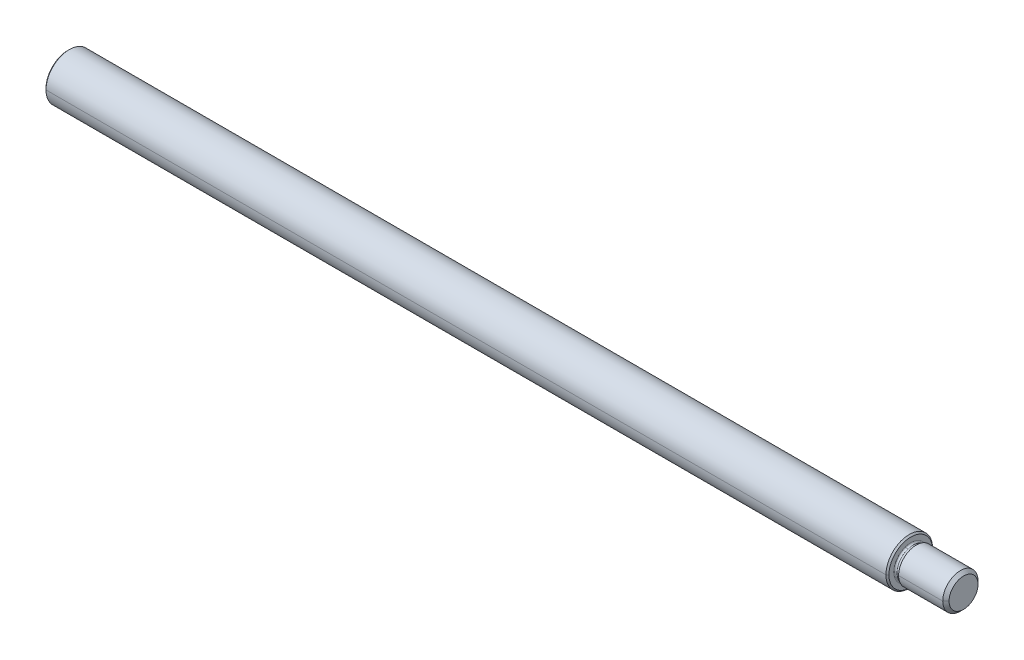
ISO-10303-21;
HEADER;
FILE_DESCRIPTION(('STEP AP214'),'2;1');
FILE_NAME('part.step','',(''),(''),'','','');
FILE_SCHEMA(('AUTOMOTIVE_DESIGN { 1 0 10303 214 1 1 1 1 }'));
ENDSEC;
DATA;
#1=APPLICATION_CONTEXT('core data for automotive mechanical design processes');
#2=APPLICATION_PROTOCOL_DEFINITION('international standard','automotive_design',2000,#1);
#3=PRODUCT_CONTEXT('',#1,'mechanical');
#4=PRODUCT('Part','Part','',(#3));
#5=PRODUCT_RELATED_PRODUCT_CATEGORY('part','',(#4));
#6=PRODUCT_DEFINITION_FORMATION('','',#4);
#7=PRODUCT_DEFINITION_CONTEXT('part definition',#1,'design');
#8=PRODUCT_DEFINITION('design','',#6,#7);
#9=PRODUCT_DEFINITION_SHAPE('','',#8);
#10=(LENGTH_UNIT() NAMED_UNIT(*) SI_UNIT(.MILLI.,.METRE.));
#11=(NAMED_UNIT(*) PLANE_ANGLE_UNIT() SI_UNIT($,.RADIAN.));
#12=(NAMED_UNIT(*) SI_UNIT($,.STERADIAN.) SOLID_ANGLE_UNIT());
#13=UNCERTAINTY_MEASURE_WITH_UNIT(LENGTH_MEASURE(1.E-05),#10,'distance_accuracy_value','');
#14=(GEOMETRIC_REPRESENTATION_CONTEXT(3) GLOBAL_UNCERTAINTY_ASSIGNED_CONTEXT((#13)) GLOBAL_UNIT_ASSIGNED_CONTEXT((#10,
#11,#12)) REPRESENTATION_CONTEXT('',''));
#15=CARTESIAN_POINT('',(0.,0.,0.));
#16=DIRECTION('',(0.,0.,1.));
#17=DIRECTION('',(1.,0.,0.));
#18=AXIS2_PLACEMENT_3D('',#15,#16,#17);
#19=CARTESIAN_POINT('',(-152.4,0.,0.));
#20=DIRECTION('',(1.,0.,0.));
#21=DIRECTION('',(0.,0.,-1.));
#22=AXIS2_PLACEMENT_3D('',#19,#20,#21);
#23=PLANE('',#22);
#24=CARTESIAN_POINT('',(-152.4,0.,0.));
#25=DIRECTION('',(1.,0.,0.));
#26=DIRECTION('',(0.,0.,-1.));
#27=AXIS2_PLACEMENT_3D('',#24,#25,#26);
#28=CIRCLE('',#27,7.4295);
#29=CARTESIAN_POINT('',(-152.4,0.,7.4295));
#30=VERTEX_POINT('',#29);
#31=CARTESIAN_POINT('',(-152.4,0.,-7.4295));
#32=VERTEX_POINT('',#31);
#33=EDGE_CURVE('E11',#30,#32,#28,.T.);
#34=ORIENTED_EDGE('',*,*,#33,.F.);
#35=CARTESIAN_POINT('',(-152.4,0.,0.));
#36=DIRECTION('',(1.,0.,0.));
#37=DIRECTION('',(0.,0.,-1.));
#38=AXIS2_PLACEMENT_3D('',#35,#36,#37);
#39=CIRCLE('',#38,7.4295);
#40=EDGE_CURVE('E25',#32,#30,#39,.T.);
#41=ORIENTED_EDGE('',*,*,#40,.F.);
#42=EDGE_LOOP('',(#34,#41));
#43=FACE_BOUND('',#42,.T.);
#44=ADVANCED_FACE('F17',(#43),#23,.F.);
#45=CARTESIAN_POINT('',(-152.4,0.,0.));
#46=DIRECTION('',(1.,0.,0.));
#47=DIRECTION('',(0.,-1.,0.));
#48=AXIS2_PLACEMENT_3D('',#45,#46,#47);
#49=CONICAL_SURFACE('',#48,7.4295,0.785398163397385);
#50=DIRECTION('',(0.707106781186591,0.,0.707106781186504));
#51=VECTOR('',#50,1.);
#52=CARTESIAN_POINT('',(-152.4,0.,7.4295));
#53=LINE('',#52,#51);
#54=CARTESIAN_POINT('',(-151.892,0.,7.93749999999997));
#55=VERTEX_POINT('',#54);
#56=EDGE_CURVE('E331',#30,#55,#53,.T.);
#57=ORIENTED_EDGE('',*,*,#56,.T.);
#58=CARTESIAN_POINT('',(-151.892,0.,0.));
#59=DIRECTION('',(1.,0.,0.));
#60=DIRECTION('',(0.,0.,-1.));
#61=AXIS2_PLACEMENT_3D('',#58,#59,#60);
#62=CIRCLE('',#61,7.9375);
#63=CARTESIAN_POINT('',(-151.892,0.,-7.9375));
#64=VERTEX_POINT('',#63);
#65=EDGE_CURVE('E326',#64,#55,#62,.T.);
#66=ORIENTED_EDGE('',*,*,#65,.F.);
#67=DIRECTION('',(0.707106781186591,0.,-0.707106781186504));
#68=VECTOR('',#67,1.);
#69=CARTESIAN_POINT('',(-152.4,0.,-7.4295));
#70=LINE('',#69,#68);
#71=EDGE_CURVE('E321',#32,#64,#70,.T.);
#72=ORIENTED_EDGE('',*,*,#71,.F.);
#73=ORIENTED_EDGE('',*,*,#40,.T.);
#74=EDGE_LOOP('',(#57,#66,#72,#73));
#75=FACE_BOUND('',#74,.T.);
#76=ADVANCED_FACE('F260',(#75),#49,.T.);
#77=CARTESIAN_POINT('',(-152.4,0.,0.));
#78=DIRECTION('',(1.,0.,0.));
#79=DIRECTION('',(0.,1.,0.));
#80=AXIS2_PLACEMENT_3D('',#77,#78,#79);
#81=CONICAL_SURFACE('',#80,7.4295,0.785398163397385);
#82=ORIENTED_EDGE('',*,*,#56,.F.);
#83=ORIENTED_EDGE('',*,*,#33,.T.);
#84=ORIENTED_EDGE('',*,*,#71,.T.);
#85=CARTESIAN_POINT('',(-151.892,0.,0.));
#86=DIRECTION('',(1.,0.,0.));
#87=DIRECTION('',(0.,0.,-1.));
#88=AXIS2_PLACEMENT_3D('',#85,#86,#87);
#89=CIRCLE('',#88,7.9375);
#90=EDGE_CURVE('E316',#55,#64,#89,.T.);
#91=ORIENTED_EDGE('',*,*,#90,.F.);
#92=EDGE_LOOP('',(#82,#83,#84,#91));
#93=FACE_BOUND('',#92,.T.);
#94=ADVANCED_FACE('F264',(#93),#81,.T.);
#95=CARTESIAN_POINT('',(134.4422,0.,0.));
#96=DIRECTION('',(1.,0.,0.));
#97=DIRECTION('',(0.,1.,0.));
#98=AXIS2_PLACEMENT_3D('',#95,#96,#97);
#99=CYLINDRICAL_SURFACE('',#98,7.9375);
#100=DIRECTION('',(1.,0.,0.));
#101=VECTOR('',#100,1.);
#102=CARTESIAN_POINT('',(-151.892,0.,7.9375));
#103=LINE('',#102,#101);
#104=CARTESIAN_POINT('',(133.9342,0.,7.9375));
#105=VERTEX_POINT('',#104);
#106=EDGE_CURVE('E311',#55,#105,#103,.T.);
#107=ORIENTED_EDGE('',*,*,#106,.F.);
#108=ORIENTED_EDGE('',*,*,#90,.T.);
#109=DIRECTION('',(1.,0.,0.));
#110=VECTOR('',#109,1.);
#111=CARTESIAN_POINT('',(-151.892,0.,-7.9375));
#112=LINE('',#111,#110);
#113=CARTESIAN_POINT('',(133.9342,0.,-7.9375));
#114=VERTEX_POINT('',#113);
#115=EDGE_CURVE('E307',#64,#114,#112,.T.);
#116=ORIENTED_EDGE('',*,*,#115,.T.);
#117=CARTESIAN_POINT('',(133.9342,0.,0.));
#118=DIRECTION('',(1.,0.,0.));
#119=DIRECTION('',(0.,0.,-1.));
#120=AXIS2_PLACEMENT_3D('',#117,#118,#119);
#121=CIRCLE('',#120,7.9375);
#122=EDGE_CURVE('E290',#105,#114,#121,.T.);
#123=ORIENTED_EDGE('',*,*,#122,.F.);
#124=EDGE_LOOP('',(#107,#108,#116,#123));
#125=FACE_BOUND('',#124,.T.);
#126=ADVANCED_FACE('F269',(#125),#99,.T.);
#127=CARTESIAN_POINT('',(133.9342,0.,0.));
#128=DIRECTION('',(-1.,0.,0.));
#129=DIRECTION('',(0.,1.,0.));
#130=AXIS2_PLACEMENT_3D('',#127,#128,#129);
#131=CONICAL_SURFACE('',#130,7.9375,0.785398163397412);
#132=DIRECTION('',(-0.707106781186583,0.,-0.707106781186512));
#133=VECTOR('',#132,1.);
#134=CARTESIAN_POINT('',(134.4422,0.,-7.42950000000001));
#135=LINE('',#134,#133);
#136=CARTESIAN_POINT('',(134.4422,0.,-7.4295));
#137=VERTEX_POINT('',#136);
#138=EDGE_CURVE('E284',#137,#114,#135,.T.);
#139=ORIENTED_EDGE('',*,*,#138,.F.);
#140=CARTESIAN_POINT('',(134.4422,0.,0.));
#141=DIRECTION('',(1.,0.,0.));
#142=DIRECTION('',(0.,0.,-1.));
#143=AXIS2_PLACEMENT_3D('',#140,#141,#142);
#144=CIRCLE('',#143,7.4295);
#145=CARTESIAN_POINT('',(134.4422,0.,7.42950000000001));
#146=VERTEX_POINT('',#145);
#147=EDGE_CURVE('E288',#146,#137,#144,.T.);
#148=ORIENTED_EDGE('',*,*,#147,.F.);
#149=DIRECTION('',(-0.707106781186583,0.,0.707106781186512));
#150=VECTOR('',#149,1.);
#151=CARTESIAN_POINT('',(134.4422,0.,7.42950000000001));
#152=LINE('',#151,#150);
#153=EDGE_CURVE('E294',#146,#105,#152,.T.);
#154=ORIENTED_EDGE('',*,*,#153,.T.);
#155=ORIENTED_EDGE('',*,*,#122,.T.);
#156=EDGE_LOOP('',(#139,#148,#154,#155));
#157=FACE_BOUND('',#156,.T.);
#158=ADVANCED_FACE('F274',(#157),#131,.T.);
#159=CARTESIAN_POINT('',(133.9342,0.,0.));
#160=DIRECTION('',(-1.,0.,0.));
#161=DIRECTION('',(0.,-1.,0.));
#162=AXIS2_PLACEMENT_3D('',#159,#160,#161);
#163=CONICAL_SURFACE('',#162,7.9375,0.785398163397412);
#164=ORIENTED_EDGE('',*,*,#138,.T.);
#165=CARTESIAN_POINT('',(133.9342,0.,0.));
#166=DIRECTION('',(1.,0.,0.));
#167=DIRECTION('',(0.,0.,-1.));
#168=AXIS2_PLACEMENT_3D('',#165,#166,#167);
#169=CIRCLE('',#168,7.9375);
#170=EDGE_CURVE('E295',#114,#105,#169,.T.);
#171=ORIENTED_EDGE('',*,*,#170,.T.);
#172=ORIENTED_EDGE('',*,*,#153,.F.);
#173=CARTESIAN_POINT('',(134.4422,0.,0.));
#174=DIRECTION('',(1.,0.,0.));
#175=DIRECTION('',(0.,0.,-1.));
#176=AXIS2_PLACEMENT_3D('',#173,#174,#175);
#177=CIRCLE('',#176,7.4295);
#178=EDGE_CURVE('E223',#137,#146,#177,.T.);
#179=ORIENTED_EDGE('',*,*,#178,.F.);
#180=EDGE_LOOP('',(#164,#171,#172,#179));
#181=FACE_BOUND('',#180,.T.);
#182=ADVANCED_FACE('F192',(#181),#163,.T.);
#183=CARTESIAN_POINT('',(134.4422,7.4295,0.));
#184=DIRECTION('',(-1.,0.,0.));
#185=DIRECTION('',(0.,0.,1.));
#186=AXIS2_PLACEMENT_3D('',#183,#184,#185);
#187=PLANE('',#186);
#188=CARTESIAN_POINT('',(134.4422,5.4760734669325,1.77928412742479));
#189=CARTESIAN_POINT('',(134.4422,5.4469618697612,1.86888687805206));
#190=CARTESIAN_POINT('',(134.4422,5.41564742644602,1.95777370177562));
#191=CARTESIAN_POINT('',(134.4422,5.34869649858891,2.13390448070103));
#192=CARTESIAN_POINT('',(134.4422,5.31306001404697,2.22114843590288));
#193=CARTESIAN_POINT('',(134.4422,5.23754865479731,2.39378246307057));
#194=CARTESIAN_POINT('',(134.4422,5.19767378008959,2.47917253503641));
#195=CARTESIAN_POINT('',(134.4422,5.11378229215661,2.647893307678));
#196=CARTESIAN_POINT('',(134.4422,5.06976567893136,2.73122400835375));
#197=CARTESIAN_POINT('',(134.4422,4.97769659586184,2.8956252274086));
#198=CARTESIAN_POINT('',(134.4422,4.92964412601757,2.97669574578771));
#199=CARTESIAN_POINT('',(134.4422,4.82961913464889,3.13638131035984));
#200=CARTESIAN_POINT('',(134.4422,4.77764661312448,3.21499635655287));
#201=CARTESIAN_POINT('',(134.4422,4.6699067134098,3.36958158190931));
#202=CARTESIAN_POINT('',(134.4422,4.61413933521953,3.44555176107274));
#203=CARTESIAN_POINT('',(134.4422,4.49894407371101,3.59466423470941));
#204=CARTESIAN_POINT('',(134.4422,4.43951619039275,3.66780652918265));
#205=CARTESIAN_POINT('',(134.4422,4.31714308479009,3.81108702693553));
#206=CARTESIAN_POINT('',(134.4422,4.25419786250569,3.88122523021516));
#207=CARTESIAN_POINT('',(134.4422,4.12494171974278,4.01832857658866));
#208=CARTESIAN_POINT('',(134.4422,4.05863079926427,4.08529371968253));
#209=CARTESIAN_POINT('',(134.4422,3.92280300887025,4.21588962076714));
#210=CARTESIAN_POINT('',(134.4422,3.85328613895474,4.27952037875786));
#211=CARTESIAN_POINT('',(134.4422,3.71121392193099,4.40329421757273));
#212=CARTESIAN_POINT('',(134.4422,3.63865857482274,4.46343729839687));
#213=CARTESIAN_POINT('',(134.4422,3.49068419559558,4.58009089292735));
#214=CARTESIAN_POINT('',(134.4422,3.41526516347667,4.63660140663369));
#215=CARTESIAN_POINT('',(134.4422,3.26174510528362,4.74585372815174));
#216=CARTESIAN_POINT('',(134.4422,3.18364407920948,4.79859553596345));
#217=CARTESIAN_POINT('',(134.4422,3.02494818531831,4.90018338605748));
#218=CARTESIAN_POINT('',(134.4422,2.94435331750129,4.94902942833979));
#219=CARTESIAN_POINT('',(134.4422,2.7808639002203,5.04270807298079));
#220=CARTESIAN_POINT('',(134.4422,2.69796935075633,5.08754067533947));
#221=CARTESIAN_POINT('',(134.4422,2.53008027041177,5.17308443446724));
#222=CARTESIAN_POINT('',(134.4422,2.44508573953119,5.21379559123632));
#223=CARTESIAN_POINT('',(134.4422,2.27320145562296,5.29099838244237));
#224=CARTESIAN_POINT('',(134.4422,2.1863117025953,5.32749001687933));
#225=CARTESIAN_POINT('',(134.4422,2.01084629941861,5.39616585187748));
#226=CARTESIAN_POINT('',(134.4422,1.92227064926958,5.42835005243866));
#227=CARTESIAN_POINT('',(134.4422,1.74364683834964,5.4883334851271));
#228=CARTESIAN_POINT('',(134.4422,1.65359867757874,5.51613271725436));
#229=CARTESIAN_POINT('',(134.4422,1.47224677932166,5.56727924228982));
#230=CARTESIAN_POINT('',(134.4422,1.38094304183547,5.59062653519803));
#231=CARTESIAN_POINT('',(134.4422,1.1972999488487,5.63281293612179));
#232=CARTESIAN_POINT('',(134.4422,1.1049605933481,5.65165204413735));
#233=CARTESIAN_POINT('',(134.4422,0.919468717927874,5.68477669021451));
#234=CARTESIAN_POINT('',(134.4422,0.826316198008239,5.6990622282761));
#235=CARTESIAN_POINT('',(134.4422,0.639422406329614,5.72304531933286));
#236=CARTESIAN_POINT('',(134.4422,0.545681134570623,5.73274287232803));
#237=CARTESIAN_POINT('',(134.4422,0.357835670147717,5.74752663099738));
#238=CARTESIAN_POINT('',(134.4422,0.263731477483802,5.75261283667155));
#239=CARTESIAN_POINT('',(134.4422,0.0753868764937317,5.75816164758394));
#240=CARTESIAN_POINT('',(134.4422,-0.0188535318324239,5.75862425282216));
#241=CARTESIAN_POINT('',(134.4422,-0.207243530748836,5.75492474840609));
#242=CARTESIAN_POINT('',(134.4422,-0.301393121339093,5.7507626387518));
#243=CARTESIAN_POINT('',(134.4422,-0.489374670173443,5.73782373143745));
#244=CARTESIAN_POINT('',(134.4422,-0.583206628417536,5.72904693377738));
#245=CARTESIAN_POINT('',(134.4422,-0.770326863153443,5.70689979452577));
#246=CARTESIAN_POINT('',(134.4422,-0.863615139645256,5.69352945293424));
#247=CARTESIAN_POINT('',(134.4422,-1.04942327124744,5.6622274361437));
#248=CARTESIAN_POINT('',(134.4422,-1.14194312635782,5.6442957609447));
#249=CARTESIAN_POINT('',(134.4422,-1.32599152676238,5.6039142759154));
#250=CARTESIAN_POINT('',(134.4422,-1.41752007205657,5.58146446608512));
#251=CARTESIAN_POINT('',(134.4422,-1.59936535254621,5.53210079535151));
#252=CARTESIAN_POINT('',(134.4422,-1.68968208774165,5.50518693444819));
#253=CARTESIAN_POINT('',(134.4422,-1.8688861671079,5.44695999941682));
#254=CARTESIAN_POINT('',(134.4422,-1.9577735112787,5.41564692528876));
#255=CARTESIAN_POINT('',(134.4422,-2.13390467119793,5.34869699974618));
#256=CARTESIAN_POINT('',(134.4422,-2.22114848694636,5.31306014833166));
#257=CARTESIAN_POINT('',(134.4422,-2.39378241202706,5.23754852051263));
#258=CARTESIAN_POINT('',(134.4422,-2.47917252135933,5.19767374410812));
#259=CARTESIAN_POINT('',(134.4422,-2.64789332135505,5.11378232813809));
#260=CARTESIAN_POINT('',(134.4422,-2.73122401201849,5.06976568857257));
#261=CARTESIAN_POINT('',(134.4422,-2.89562522374383,4.97769658622064));
#262=CARTESIAN_POINT('',(134.4422,-2.97669574480573,4.92964412343422));
#263=CARTESIAN_POINT('',(134.4422,-3.1363813113418,4.82961913723225));
#264=CARTESIAN_POINT('',(134.4422,-3.21499635681598,4.77764661381669));
#265=CARTESIAN_POINT('',(134.4422,-3.36958158164619,4.6699067127176));
#266=CARTESIAN_POINT('',(134.4422,-3.44555176100223,4.61413933503406));
#267=CARTESIAN_POINT('',(134.4422,-3.5946642347799,4.49894407389649));
#268=CARTESIAN_POINT('',(134.4422,-3.66780652920154,4.43951619044245));
#269=CARTESIAN_POINT('',(134.4422,-3.81108702691663,4.3171430847404));
#270=CARTESIAN_POINT('',(134.4422,-3.88122523021009,4.25419786249238));
#271=CARTESIAN_POINT('',(134.4422,-4.01832857659371,4.12494171975611));
#272=CARTESIAN_POINT('',(134.4422,-4.08529371968388,4.05863079926784));
#273=CARTESIAN_POINT('',(134.4422,-4.21588962076577,3.92280300886669));
#274=CARTESIAN_POINT('',(134.4422,-4.27952037875749,3.85328613895379));
#275=CARTESIAN_POINT('',(134.4422,-4.40329421757309,3.71121392193195));
#276=CARTESIAN_POINT('',(134.4422,-4.46343729839696,3.638658574823));
#277=CARTESIAN_POINT('',(134.4422,-4.58009089292725,3.49068419559533));
#278=CARTESIAN_POINT('',(134.4422,-4.63660140663366,3.41526516347661));
#279=CARTESIAN_POINT('',(134.4422,-4.74585372815176,3.2617451052837));
#280=CARTESIAN_POINT('',(134.4422,-4.79859553596345,3.1836440792095));
#281=CARTESIAN_POINT('',(134.4422,-4.90018338605746,3.02494818531831));
#282=CARTESIAN_POINT('',(134.4422,-4.94902942833978,2.9443533175013));
#283=CARTESIAN_POINT('',(134.4422,-5.04270807298078,2.78086390022031));
#284=CARTESIAN_POINT('',(134.4422,-5.08754067533947,2.69796935075634));
#285=CARTESIAN_POINT('',(134.4422,-5.17308443446723,2.53008027041178));
#286=CARTESIAN_POINT('',(134.4422,-5.21379559123632,2.4450857395312));
#287=CARTESIAN_POINT('',(134.4422,-5.29099838244237,2.27320145562296));
#288=CARTESIAN_POINT('',(134.4422,-5.32749001687935,2.18631170259531));
#289=CARTESIAN_POINT('',(134.4422,-5.39616585187745,2.01084629941863));
#290=CARTESIAN_POINT('',(134.4422,-5.42835005243859,1.92227064926961));
#291=CARTESIAN_POINT('',(134.4422,-5.48833348512717,1.74364683834963));
#292=CARTESIAN_POINT('',(134.4422,-5.51613271725462,1.65359867757868));
#293=CARTESIAN_POINT('',(134.4422,-5.56727924228955,1.47224677932174));
#294=CARTESIAN_POINT('',(134.4422,-5.59062653519704,1.38094304183576));
#295=CARTESIAN_POINT('',(134.4422,-5.63281293612278,1.19729994884844));
#296=CARTESIAN_POINT('',(134.4422,-5.65165204414103,1.10496059334711));
#297=CARTESIAN_POINT('',(134.4422,-5.68477669021082,0.919468717928886));
#298=CARTESIAN_POINT('',(134.4422,-5.69906222826235,0.826316198011985));
#299=CARTESIAN_POINT('',(134.4422,-5.72304531934661,0.639422406325896));
#300=CARTESIAN_POINT('',(134.4422,-5.73274287237934,0.545681134556707));
#301=CARTESIAN_POINT('',(134.4422,-5.74752663094606,0.357835670161657));
#302=CARTESIAN_POINT('',(134.4422,-5.75261283648006,0.263731477535797));
#303=CARTESIAN_POINT('',(134.4422,-5.75816164777544,0.075386876441761));
#304=CARTESIAN_POINT('',(134.4422,-5.75862425353682,-0.0188535320264151));
#305=CARTESIAN_POINT('',(134.4422,-5.75492474769142,-0.207243530554822));
#306=CARTESIAN_POINT('',(134.4422,-5.75076263608464,-0.301393120615053));
#307=CARTESIAN_POINT('',(134.4422,-5.73782373410461,-0.489374670897458));
#308=CARTESIAN_POINT('',(134.4422,-5.72904694373137,-0.583206631119631));
#309=CARTESIAN_POINT('',(134.4422,-5.70689978457178,-0.770326860451321));
#310=CARTESIAN_POINT('',(134.4422,-5.69352941578544,-0.863615129560838));
#311=CARTESIAN_POINT('',(134.4422,-5.6622274732925,-1.04942328133183));
#312=CARTESIAN_POINT('',(134.4422,-5.6442958995859,-1.1419431639933));
#313=CARTESIAN_POINT('',(134.4422,-5.6039141372742,-1.32599148912686));
#314=CARTESIAN_POINT('',(134.4422,-5.5814639486691,-1.41751993159895));
#315=CARTESIAN_POINT('',(134.4422,-5.53210131276754,-1.59936549300381));
#316=CARTESIAN_POINT('',(134.4422,-5.50518886547108,-1.68968261193659));
#317=CARTESIAN_POINT('',(134.4422,-5.47607346693251,-1.77928412742477));
#318=B_SPLINE_CURVE_WITH_KNOTS('',3,(#188,#189,#190,#191,#192,#193,#194,#195,#196,#197,#198,
#199,#200,#201,#202,#203,#204,#205,#206,#207,#208,#209,#210,#211,#212,#213,#214,#215,#216,#217,
#218,#219,#220,#221,#222,#223,#224,#225,#226,#227,#228,#229,#230,#231,#232,#233,#234,#235,#236,
#237,#238,#239,#240,#241,#242,#243,#244,#245,#246,#247,#248,#249,#250,#251,#252,#253,#254,#255,
#256,#257,#258,#259,#260,#261,#262,#263,#264,#265,#266,#267,#268,#269,#270,#271,#272,#273,#274,
#275,#276,#277,#278,#279,#280,#281,#282,#283,#284,#285,#286,#287,#288,#289,#290,#291,#292,#293,
#294,#295,#296,#297,#298,#299,#300,#301,#302,#303,#304,#305,#306,#307,#308,#309,#310,#311,#312,
#313,#314,#315,#316,#317),.UNSPECIFIED.,.F.,.F.,(4,2,2,2,2,2,2,2,2,2,2,2,2,2,2,2,2,2,2,2,2,2,2,
2,2,2,2,2,2,2,2,2,2,2,2,2,2,2,2,2,2,2,2,2,2,2,2,2,2,2,2,2,2,2,2,2,2,2,2,2,2,2,2,2,4),(0.,
0.282611113130821,0.565222226261641,0.847833339392463,1.13044445252328,1.4130555656541,
1.69566667878493,1.97827779191574,2.26088890504657,2.54350001817739,2.82611113130821,
3.10872224443903,3.39133335756985,3.67394447070067,3.95655558383149,4.23916669696231,
4.52177781009313,4.80438892322395,5.08700003635477,5.3696111494856,5.65222226261641,
5.93483337574724,6.21744448887806,6.50005560200888,6.7826667151397,7.06527782827052,
7.34788894140134,7.63050005453216,7.91311116766298,8.1957222807938,8.47833339392462,
8.76094450705544,9.04355562018626,9.32616673331708,9.6087778464479,9.89138895957872,
10.1740000727095,10.4566111858404,10.7392222989712,11.021833412102,11.3044445252328,
11.5870556383636,11.8696667514945,12.1522778646253,12.4348889777561,12.7175000908869,
13.0001112040178,13.2827223171486,13.5653334302794,13.8479445434102,14.130555656541,
14.4131667696719,14.6957778828027,14.9783889959335,15.2610001090643,15.5436112221951,
15.826222335326,16.1088334484568,16.3914445615876,16.6740556747184,16.9566667878492,
17.2392779009801,17.5218890141109,17.8045001272417,18.0871112403725),.UNSPECIFIED.);
#319=CARTESIAN_POINT('',(134.4422,5.4760734669325,1.77928412742479));
#320=VERTEX_POINT('',#319);
#321=CARTESIAN_POINT('',(134.4422,-5.4760734669325,-1.77928412742479));
#322=VERTEX_POINT('',#321);
#323=EDGE_CURVE('E215',#320,#322,#318,.T.);
#324=ORIENTED_EDGE('',*,*,#323,.F.);
#325=CARTESIAN_POINT('',(134.4422,-5.4760734669325,-1.77928412742479));
#326=CARTESIAN_POINT('',(134.4422,-5.4469618697612,-1.86888687805205));
#327=CARTESIAN_POINT('',(134.4422,-5.41564742644602,-1.95777370177562));
#328=CARTESIAN_POINT('',(134.4422,-5.34869649858891,-2.13390448070103));
#329=CARTESIAN_POINT('',(134.4422,-5.31306001404697,-2.22114843590287));
#330=CARTESIAN_POINT('',(134.4422,-5.23754865479731,-2.39378246307056));
#331=CARTESIAN_POINT('',(134.4422,-5.19767378008959,-2.47917253503641));
#332=CARTESIAN_POINT('',(134.4422,-5.11378229215661,-2.647893307678));
#333=CARTESIAN_POINT('',(134.4422,-5.06976567893136,-2.73122400835374));
#334=CARTESIAN_POINT('',(134.4422,-4.97769659586184,-2.8956252274086));
#335=CARTESIAN_POINT('',(134.4422,-4.92964412601757,-2.97669574578771));
#336=CARTESIAN_POINT('',(134.4422,-4.82961913464889,-3.13638131035984));
#337=CARTESIAN_POINT('',(134.4422,-4.77764661312448,-3.21499635655286));
#338=CARTESIAN_POINT('',(134.4422,-4.6699067134098,-3.36958158190931));
#339=CARTESIAN_POINT('',(134.4422,-4.61413933521953,-3.44555176107274));
#340=CARTESIAN_POINT('',(134.4422,-4.49894407371101,-3.59466423470941));
#341=CARTESIAN_POINT('',(134.4422,-4.43951619039275,-3.66780652918265));
#342=CARTESIAN_POINT('',(134.4422,-4.3171430847901,-3.81108702693553));
#343=CARTESIAN_POINT('',(134.4422,-4.25419786250569,-3.88122523021516));
#344=CARTESIAN_POINT('',(134.4422,-4.12494171974278,-4.01832857658866));
#345=CARTESIAN_POINT('',(134.4422,-4.05863079926427,-4.08529371968253));
#346=CARTESIAN_POINT('',(134.4422,-3.92280300887025,-4.21588962076713));
#347=CARTESIAN_POINT('',(134.4422,-3.85328613895474,-4.27952037875786));
#348=CARTESIAN_POINT('',(134.4422,-3.71121392193099,-4.40329421757273));
#349=CARTESIAN_POINT('',(134.4422,-3.63865857482274,-4.46343729839687));
#350=CARTESIAN_POINT('',(134.4422,-3.49068419559558,-4.58009089292735));
#351=CARTESIAN_POINT('',(134.4422,-3.41526516347667,-4.63660140663369));
#352=CARTESIAN_POINT('',(134.4422,-3.26174510528362,-4.74585372815174));
#353=CARTESIAN_POINT('',(134.4422,-3.18364407920948,-4.79859553596345));
#354=CARTESIAN_POINT('',(134.4422,-3.02494818531832,-4.90018338605747));
#355=CARTESIAN_POINT('',(134.4422,-2.9443533175013,-4.94902942833979));
#356=CARTESIAN_POINT('',(134.4422,-2.7808639002203,-5.04270807298079));
#357=CARTESIAN_POINT('',(134.4422,-2.69796935075633,-5.08754067533947));
#358=CARTESIAN_POINT('',(134.4422,-2.53008027041177,-5.17308443446724));
#359=CARTESIAN_POINT('',(134.4422,-2.44508573953119,-5.21379559123632));
#360=CARTESIAN_POINT('',(134.4422,-2.27320145562296,-5.29099838244237));
#361=CARTESIAN_POINT('',(134.4422,-2.18631170259531,-5.32749001687933));
#362=CARTESIAN_POINT('',(134.4422,-2.01084629941862,-5.39616585187748));
#363=CARTESIAN_POINT('',(134.4422,-1.92227064926958,-5.42835005243866));
#364=CARTESIAN_POINT('',(134.4422,-1.74364683834964,-5.4883334851271));
#365=CARTESIAN_POINT('',(134.4422,-1.65359867757874,-5.51613271725436));
#366=CARTESIAN_POINT('',(134.4422,-1.47224677932166,-5.56727924228982));
#367=CARTESIAN_POINT('',(134.4422,-1.38094304183548,-5.59062653519803));
#368=CARTESIAN_POINT('',(134.4422,-1.1972999488487,-5.63281293612179));
#369=CARTESIAN_POINT('',(134.4422,-1.10496059334811,-5.65165204413735));
#370=CARTESIAN_POINT('',(134.4422,-0.919468717927879,-5.6847766902145));
#371=CARTESIAN_POINT('',(134.4422,-0.826316198008245,-5.6990622282761));
#372=CARTESIAN_POINT('',(134.4422,-0.63942240632962,-5.72304531933286));
#373=CARTESIAN_POINT('',(134.4422,-0.545681134570629,-5.73274287232803));
#374=CARTESIAN_POINT('',(134.4422,-0.357835670147723,-5.74752663099738));
#375=CARTESIAN_POINT('',(134.4422,-0.263731477483808,-5.75261283667155));
#376=CARTESIAN_POINT('',(134.4422,-0.0753868764937364,-5.75816164758394));
#377=CARTESIAN_POINT('',(134.4422,0.01885353183242,-5.75862425282216));
#378=CARTESIAN_POINT('',(134.4422,0.207243530748832,-5.75492474840609));
#379=CARTESIAN_POINT('',(134.4422,0.301393121339088,-5.7507626387518));
#380=CARTESIAN_POINT('',(134.4422,0.489374670173438,-5.73782373143745));
#381=CARTESIAN_POINT('',(134.4422,0.583206628417531,-5.72904693377738));
#382=CARTESIAN_POINT('',(134.4422,0.770326863153435,-5.70689979452577));
#383=CARTESIAN_POINT('',(134.4422,0.863615139645247,-5.69352945293424));
#384=CARTESIAN_POINT('',(134.4422,1.04942327124743,-5.6622274361437));
#385=CARTESIAN_POINT('',(134.4422,1.14194312635781,-5.6442957609447));
#386=CARTESIAN_POINT('',(134.4422,1.32599152676238,-5.60391427591541));
#387=CARTESIAN_POINT('',(134.4422,1.41752007205657,-5.58146446608512));
#388=CARTESIAN_POINT('',(134.4422,1.59936535254621,-5.53210079535152));
#389=CARTESIAN_POINT('',(134.4422,1.68968208774165,-5.5051869344482));
#390=CARTESIAN_POINT('',(134.4422,1.86888616710789,-5.44695999941682));
#391=CARTESIAN_POINT('',(134.4422,1.95777351127869,-5.41564692528876));
#392=CARTESIAN_POINT('',(134.4422,2.13390467119792,-5.34869699974618));
#393=CARTESIAN_POINT('',(134.4422,2.22114848694635,-5.31306014833166));
#394=CARTESIAN_POINT('',(134.4422,2.39378241202706,-5.23754852051263));
#395=CARTESIAN_POINT('',(134.4422,2.47917252135933,-5.19767374410812));
#396=CARTESIAN_POINT('',(134.4422,2.64789332135505,-5.11378232813809));
#397=CARTESIAN_POINT('',(134.4422,2.73122401201849,-5.06976568857257));
#398=CARTESIAN_POINT('',(134.4422,2.89562522374383,-4.97769658622064));
#399=CARTESIAN_POINT('',(134.4422,2.97669574480572,-4.92964412343423));
#400=CARTESIAN_POINT('',(134.4422,3.1363813113418,-4.82961913723225));
#401=CARTESIAN_POINT('',(134.4422,3.21499635681597,-4.7776466138167));
#402=CARTESIAN_POINT('',(134.4422,3.36958158164618,-4.6699067127176));
#403=CARTESIAN_POINT('',(134.4422,3.44555176100222,-4.61413933503406));
#404=CARTESIAN_POINT('',(134.4422,3.5946642347799,-4.49894407389649));
#405=CARTESIAN_POINT('',(134.4422,3.66780652920153,-4.43951619044246));
#406=CARTESIAN_POINT('',(134.4422,3.81108702691662,-4.31714308474041));
#407=CARTESIAN_POINT('',(134.4422,3.88122523021008,-4.25419786249239));
#408=CARTESIAN_POINT('',(134.4422,4.01832857659371,-4.12494171975611));
#409=CARTESIAN_POINT('',(134.4422,4.08529371968388,-4.05863079926785));
#410=CARTESIAN_POINT('',(134.4422,4.21588962076577,-3.92280300886669));
#411=CARTESIAN_POINT('',(134.4422,4.27952037875749,-3.8532861389538));
#412=CARTESIAN_POINT('',(134.4422,4.40329421757308,-3.71121392193196));
#413=CARTESIAN_POINT('',(134.4422,4.46343729839695,-3.63865857482301));
#414=CARTESIAN_POINT('',(134.4422,4.58009089292724,-3.49068419559534));
#415=CARTESIAN_POINT('',(134.4422,4.63660140663365,-3.41526516347662));
#416=CARTESIAN_POINT('',(134.4422,4.74585372815175,-3.2617451052837));
#417=CARTESIAN_POINT('',(134.4422,4.79859553596345,-3.18364407920951));
#418=CARTESIAN_POINT('',(134.4422,4.90018338605746,-3.02494818531831));
#419=CARTESIAN_POINT('',(134.4422,4.94902942833978,-2.94435331750131));
#420=CARTESIAN_POINT('',(134.4422,5.04270807298078,-2.78086390022032));
#421=CARTESIAN_POINT('',(134.4422,5.08754067533946,-2.69796935075634));
#422=CARTESIAN_POINT('',(134.4422,5.17308443446723,-2.53008027041179));
#423=CARTESIAN_POINT('',(134.4422,5.21379559123631,-2.44508573953121));
#424=CARTESIAN_POINT('',(134.4422,5.29099838244237,-2.27320145562297));
#425=CARTESIAN_POINT('',(134.4422,5.32749001687934,-2.18631170259532));
#426=CARTESIAN_POINT('',(134.4422,5.39616585187745,-2.01084629941864));
#427=CARTESIAN_POINT('',(134.4422,5.42835005243858,-1.92227064926962));
#428=CARTESIAN_POINT('',(134.4422,5.48833348512717,-1.74364683834964));
#429=CARTESIAN_POINT('',(134.4422,5.51613271725462,-1.65359867757869));
#430=CARTESIAN_POINT('',(134.4422,5.56727924228955,-1.47224677932175));
#431=CARTESIAN_POINT('',(134.4422,5.59062653519704,-1.38094304183576));
#432=CARTESIAN_POINT('',(134.4422,5.63281293612278,-1.19729994884845));
#433=CARTESIAN_POINT('',(134.4422,5.65165204414103,-1.10496059334712));
#434=CARTESIAN_POINT('',(134.4422,5.68477669021082,-0.919468717928895));
#435=CARTESIAN_POINT('',(134.4422,5.69906222826235,-0.826316198011993));
#436=CARTESIAN_POINT('',(134.4422,5.72304531934661,-0.639422406325903));
#437=CARTESIAN_POINT('',(134.4422,5.73274287237934,-0.545681134556716));
#438=CARTESIAN_POINT('',(134.4422,5.74752663094606,-0.357835670161668));
#439=CARTESIAN_POINT('',(134.4422,5.75261283648006,-0.263731477535808));
#440=CARTESIAN_POINT('',(134.4422,5.75816164777544,-0.0753868764417721));
#441=CARTESIAN_POINT('',(134.4422,5.75862425353682,0.018853532026404));
#442=CARTESIAN_POINT('',(134.4422,5.75492474769142,0.207243530554811));
#443=CARTESIAN_POINT('',(134.4422,5.75076263608464,0.301393120615042));
#444=CARTESIAN_POINT('',(134.4422,5.73782373410461,0.489374670897447));
#445=CARTESIAN_POINT('',(134.4422,5.72904694373137,0.58320663111962));
#446=CARTESIAN_POINT('',(134.4422,5.70689978457178,0.770326860451312));
#447=CARTESIAN_POINT('',(134.4422,5.69352941578544,0.86361512956083));
#448=CARTESIAN_POINT('',(134.4422,5.6622274732925,1.04942328133182));
#449=CARTESIAN_POINT('',(134.4422,5.6442958995859,1.1419431639933));
#450=CARTESIAN_POINT('',(134.4422,5.6039141372742,1.32599148912686));
#451=CARTESIAN_POINT('',(134.4422,5.5814639486691,1.41751993159894));
#452=CARTESIAN_POINT('',(134.4422,5.53210131276754,1.5993654930038));
#453=CARTESIAN_POINT('',(134.4422,5.50518886547108,1.68968261193658));
#454=CARTESIAN_POINT('',(134.4422,5.47607346693251,1.77928412742476));
#455=B_SPLINE_CURVE_WITH_KNOTS('',3,(#325,#326,#327,#328,#329,#330,#331,#332,#333,#334,#335,
#336,#337,#338,#339,#340,#341,#342,#343,#344,#345,#346,#347,#348,#349,#350,#351,#352,#353,#354,
#355,#356,#357,#358,#359,#360,#361,#362,#363,#364,#365,#366,#367,#368,#369,#370,#371,#372,#373,
#374,#375,#376,#377,#378,#379,#380,#381,#382,#383,#384,#385,#386,#387,#388,#389,#390,#391,#392,
#393,#394,#395,#396,#397,#398,#399,#400,#401,#402,#403,#404,#405,#406,#407,#408,#409,#410,#411,
#412,#413,#414,#415,#416,#417,#418,#419,#420,#421,#422,#423,#424,#425,#426,#427,#428,#429,#430,
#431,#432,#433,#434,#435,#436,#437,#438,#439,#440,#441,#442,#443,#444,#445,#446,#447,#448,#449,
#450,#451,#452,#453,#454),.UNSPECIFIED.,.F.,.F.,(4,2,2,2,2,2,2,2,2,2,2,2,2,2,2,2,2,2,2,2,2,2,2,
2,2,2,2,2,2,2,2,2,2,2,2,2,2,2,2,2,2,2,2,2,2,2,2,2,2,2,2,2,2,2,2,2,2,2,2,2,2,2,2,2,4),(0.,
0.282611113130821,0.56522222626164,0.847833339392462,1.13044445252328,1.4130555656541,
1.69566667878492,1.97827779191574,2.26088890504656,2.54350001817739,2.82611113130821,
3.10872224443903,3.39133335756985,3.67394447070067,3.95655558383149,4.23916669696231,
4.52177781009313,4.80438892322395,5.08700003635477,5.36961114948559,5.65222226261641,
5.93483337574723,6.21744448887805,6.50005560200887,6.78266671513969,7.06527782827052,
7.34788894140134,7.63050005453216,7.91311116766298,8.19572228079379,8.47833339392462,
8.76094450705544,9.04355562018626,9.32616673331708,9.6087778464479,9.89138895957872,
10.1740000727095,10.4566111858404,10.7392222989712,11.021833412102,11.3044445252328,
11.5870556383636,11.8696667514945,12.1522778646253,12.4348889777561,12.7175000908869,
13.0001112040177,13.2827223171486,13.5653334302794,13.8479445434102,14.130555656541,
14.4131667696719,14.6957778828027,14.9783889959335,15.2610001090643,15.5436112221951,
15.826222335326,16.1088334484568,16.3914445615876,16.6740556747184,16.9566667878492,
17.2392779009801,17.5218890141109,17.8045001272417,18.0871112403725),.UNSPECIFIED.);
#456=EDGE_CURVE('E211',#322,#320,#455,.T.);
#457=ORIENTED_EDGE('',*,*,#456,.F.);
#458=EDGE_LOOP('',(#324,#457));
#459=FACE_BOUND('',#458,.T.);
#460=ORIENTED_EDGE('',*,*,#178,.T.);
#461=ORIENTED_EDGE('',*,*,#147,.T.);
#462=EDGE_LOOP('',(#460,#461));
#463=FACE_BOUND('',#462,.T.);
#464=ADVANCED_FACE('F186',(#459,#463),#187,.F.);
#465=CARTESIAN_POINT('',(134.9222,0.,0.));
#466=DIRECTION('',(1.,0.,0.));
#467=DIRECTION('',(0.,-0.309016994374947,0.951056516295154));
#468=AXIS2_PLACEMENT_3D('',#465,#466,#467);
#469=TOROIDAL_SURFACE('',#468,5.75788438763301,0.47999999999998);
#470=CARTESIAN_POINT('',(134.9222,-5.4760734669325,-1.77928412742479));
#471=DIRECTION('',(0.,0.309016994374947,-0.951056516295154));
#472=DIRECTION('',(-1.,0.,0.));
#473=AXIS2_PLACEMENT_3D('',#470,#471,#472);
#474=CIRCLE('',#473,0.47999999999999);
#475=CARTESIAN_POINT('',(135.1622,-5.08072669723029,-1.65082817510648));
#476=VERTEX_POINT('',#475);
#477=EDGE_CURVE('E166',#322,#476,#474,.T.);
#478=ORIENTED_EDGE('',*,*,#477,.F.);
#479=ORIENTED_EDGE('',*,*,#456,.T.);
#480=CARTESIAN_POINT('',(134.9222,5.4760734669325,1.77928412742479));
#481=DIRECTION('',(0.,-0.309016994374947,0.951056516295154));
#482=DIRECTION('',(-1.,0.,0.));
#483=AXIS2_PLACEMENT_3D('',#480,#481,#482);
#484=CIRCLE('',#483,0.47999999999999);
#485=CARTESIAN_POINT('',(135.1622,5.08072669723029,1.65082817510648));
#486=VERTEX_POINT('',#485);
#487=EDGE_CURVE('E162',#320,#486,#484,.T.);
#488=ORIENTED_EDGE('',*,*,#487,.T.);
#489=CARTESIAN_POINT('',(135.1622,0.,0.));
#490=DIRECTION('',(1.,0.,0.));
#491=DIRECTION('',(0.,0.,-1.));
#492=AXIS2_PLACEMENT_3D('',#489,#490,#491);
#493=CIRCLE('',#492,5.34219219381651);
#494=CARTESIAN_POINT('',(135.1622,0.,-5.34219219381651));
#495=VERTEX_POINT('',#494);
#496=EDGE_CURVE('E157',#495,#486,#493,.T.);
#497=ORIENTED_EDGE('',*,*,#496,.F.);
#498=CARTESIAN_POINT('',(135.1622,0.,0.));
#499=DIRECTION('',(1.,0.,0.));
#500=DIRECTION('',(0.,0.,-1.));
#501=AXIS2_PLACEMENT_3D('',#498,#499,#500);
#502=CIRCLE('',#501,5.34219219381651);
#503=EDGE_CURVE('E152',#476,#495,#502,.T.);
#504=ORIENTED_EDGE('',*,*,#503,.F.);
#505=EDGE_LOOP('',(#478,#479,#488,#497,#504));
#506=FACE_BOUND('',#505,.T.);
#507=ADVANCED_FACE('F175',(#506),#469,.F.);
#508=CARTESIAN_POINT('',(135.1622,0.,0.));
#509=DIRECTION('',(1.,0.,0.));
#510=DIRECTION('',(0.,1.,0.));
#511=AXIS2_PLACEMENT_3D('',#508,#509,#510);
#512=CONICAL_SURFACE('',#511,5.34219219381651,0.523598775596482);
#513=DIRECTION('',(0.866025403785345,0.,0.49999999999843));
#514=VECTOR('',#513,1.);
#515=CARTESIAN_POINT('',(135.1622,0.,5.34219219381651));
#516=LINE('',#515,#514);
#517=CARTESIAN_POINT('',(135.1622,0.,5.34219219381651));
#518=VERTEX_POINT('',#517);
#519=CARTESIAN_POINT('',(136.30155654193,0.,5.99999999999998));
#520=VERTEX_POINT('',#519);
#521=EDGE_CURVE('E147',#518,#520,#516,.T.);
#522=ORIENTED_EDGE('',*,*,#521,.F.);
#523=CARTESIAN_POINT('',(135.1622,0.,0.));
#524=DIRECTION('',(1.,0.,0.));
#525=DIRECTION('',(0.,0.,-1.));
#526=AXIS2_PLACEMENT_3D('',#523,#524,#525);
#527=CIRCLE('',#526,5.34219219381651);
#528=EDGE_CURVE('E142',#518,#476,#527,.T.);
#529=ORIENTED_EDGE('',*,*,#528,.T.);
#530=ORIENTED_EDGE('',*,*,#503,.T.);
#531=DIRECTION('',(0.866025403785345,0.,-0.49999999999843));
#532=VECTOR('',#531,1.);
#533=CARTESIAN_POINT('',(135.1622,0.,-5.34219219381651));
#534=LINE('',#533,#532);
#535=CARTESIAN_POINT('',(136.30155654193,0.,-6.));
#536=VERTEX_POINT('',#535);
#537=EDGE_CURVE('E138',#495,#536,#534,.T.);
#538=ORIENTED_EDGE('',*,*,#537,.T.);
#539=CARTESIAN_POINT('',(136.30155654193,0.,0.));
#540=DIRECTION('',(1.,0.,0.));
#541=DIRECTION('',(0.,0.,-1.));
#542=AXIS2_PLACEMENT_3D('',#539,#540,#541);
#543=CIRCLE('',#542,6.);
#544=EDGE_CURVE('E133',#520,#536,#543,.T.);
#545=ORIENTED_EDGE('',*,*,#544,.F.);
#546=EDGE_LOOP('',(#522,#529,#530,#538,#545));
#547=FACE_BOUND('',#546,.T.);
#548=ADVANCED_FACE('F185',(#547),#512,.T.);
#549=CARTESIAN_POINT('',(152.4,0.,0.));
#550=DIRECTION('',(1.,0.,0.));
#551=DIRECTION('',(0.,1.,0.));
#552=AXIS2_PLACEMENT_3D('',#549,#550,#551);
#553=CYLINDRICAL_SURFACE('',#552,6.);
#554=DIRECTION('',(1.,0.,0.));
#555=VECTOR('',#554,1.);
#556=CARTESIAN_POINT('',(136.30155654193,0.,6.));
#557=LINE('',#556,#555);
#558=CARTESIAN_POINT('',(151.3265,0.,6.));
#559=VERTEX_POINT('',#558);
#560=EDGE_CURVE('E128',#520,#559,#557,.T.);
#561=ORIENTED_EDGE('',*,*,#560,.F.);
#562=ORIENTED_EDGE('',*,*,#544,.T.);
#563=DIRECTION('',(1.,0.,0.));
#564=VECTOR('',#563,1.);
#565=CARTESIAN_POINT('',(136.30155654193,0.,-6.));
#566=LINE('',#565,#564);
#567=CARTESIAN_POINT('',(151.3265,0.,-6.));
#568=VERTEX_POINT('',#567);
#569=EDGE_CURVE('E124',#536,#568,#566,.T.);
#570=ORIENTED_EDGE('',*,*,#569,.T.);
#571=CARTESIAN_POINT('',(151.3265,0.,0.));
#572=DIRECTION('',(1.,0.,0.));
#573=DIRECTION('',(0.,0.,-1.));
#574=AXIS2_PLACEMENT_3D('',#571,#572,#573);
#575=CIRCLE('',#574,6.);
#576=EDGE_CURVE('E120',#559,#568,#575,.T.);
#577=ORIENTED_EDGE('',*,*,#576,.F.);
#578=EDGE_LOOP('',(#561,#562,#570,#577));
#579=FACE_BOUND('',#578,.T.);
#580=ADVANCED_FACE('F247',(#579),#553,.T.);
#581=CARTESIAN_POINT('',(151.3265,0.,0.));
#582=DIRECTION('',(-1.,0.,0.));
#583=DIRECTION('',(0.,1.,0.));
#584=AXIS2_PLACEMENT_3D('',#581,#582,#583);
#585=CONICAL_SURFACE('',#584,6.,0.785398163397446);
#586=DIRECTION('',(-0.707106781186548,0.,-0.707106781186548));
#587=VECTOR('',#586,1.);
#588=CARTESIAN_POINT('',(152.4,0.,-4.9265));
#589=LINE('',#588,#587);
#590=CARTESIAN_POINT('',(152.4,0.,-4.9265));
#591=VERTEX_POINT('',#590);
#592=EDGE_CURVE('E97',#591,#568,#589,.T.);
#593=ORIENTED_EDGE('',*,*,#592,.F.);
#594=CARTESIAN_POINT('',(152.4,0.,0.));
#595=DIRECTION('',(1.,0.,0.));
#596=DIRECTION('',(0.,0.,-1.));
#597=AXIS2_PLACEMENT_3D('',#594,#595,#596);
#598=CIRCLE('',#597,4.9265);
#599=CARTESIAN_POINT('',(152.4,0.,4.9265));
#600=VERTEX_POINT('',#599);
#601=EDGE_CURVE('E90',#600,#591,#598,.T.);
#602=ORIENTED_EDGE('',*,*,#601,.F.);
#603=DIRECTION('',(-0.707106781186548,0.,0.707106781186548));
#604=VECTOR('',#603,1.);
#605=CARTESIAN_POINT('',(152.4,0.,4.9265));
#606=LINE('',#605,#604);
#607=EDGE_CURVE('E95',#600,#559,#606,.T.);
#608=ORIENTED_EDGE('',*,*,#607,.T.);
#609=ORIENTED_EDGE('',*,*,#576,.T.);
#610=EDGE_LOOP('',(#593,#602,#608,#609));
#611=FACE_BOUND('',#610,.T.);
#612=ADVANCED_FACE('F92',(#611),#585,.T.);
#613=CARTESIAN_POINT('',(151.3265,0.,0.));
#614=DIRECTION('',(-1.,0.,0.));
#615=DIRECTION('',(0.,-1.,0.));
#616=AXIS2_PLACEMENT_3D('',#613,#614,#615);
#617=CONICAL_SURFACE('',#616,6.,0.785398163397446);
#618=ORIENTED_EDGE('',*,*,#592,.T.);
#619=CARTESIAN_POINT('',(151.3265,0.,0.));
#620=DIRECTION('',(1.,0.,0.));
#621=DIRECTION('',(0.,0.,-1.));
#622=AXIS2_PLACEMENT_3D('',#619,#620,#621);
#623=CIRCLE('',#622,6.);
#624=EDGE_CURVE('E104',#568,#559,#623,.T.);
#625=ORIENTED_EDGE('',*,*,#624,.T.);
#626=ORIENTED_EDGE('',*,*,#607,.F.);
#627=CARTESIAN_POINT('',(152.4,0.,0.));
#628=DIRECTION('',(1.,0.,0.));
#629=DIRECTION('',(0.,0.,-1.));
#630=AXIS2_PLACEMENT_3D('',#627,#628,#629);
#631=CIRCLE('',#630,4.9265);
#632=EDGE_CURVE('E101',#591,#600,#631,.T.);
#633=ORIENTED_EDGE('',*,*,#632,.F.);
#634=EDGE_LOOP('',(#618,#625,#626,#633));
#635=FACE_BOUND('',#634,.T.);
#636=ADVANCED_FACE('F108',(#635),#617,.T.);
#637=CARTESIAN_POINT('',(152.4,4.9265,0.));
#638=DIRECTION('',(-1.,0.,0.));
#639=DIRECTION('',(0.,0.,1.));
#640=AXIS2_PLACEMENT_3D('',#637,#638,#639);
#641=PLANE('',#640);
#642=ORIENTED_EDGE('',*,*,#632,.T.);
#643=ORIENTED_EDGE('',*,*,#601,.T.);
#644=EDGE_LOOP('',(#642,#643));
#645=FACE_BOUND('',#644,.T.);
#646=ADVANCED_FACE('F102',(#645),#641,.F.);
#647=CARTESIAN_POINT('',(152.4,0.,0.));
#648=DIRECTION('',(1.,0.,0.));
#649=DIRECTION('',(0.,-1.,0.));
#650=AXIS2_PLACEMENT_3D('',#647,#648,#649);
#651=CYLINDRICAL_SURFACE('',#650,6.);
#652=ORIENTED_EDGE('',*,*,#560,.T.);
#653=ORIENTED_EDGE('',*,*,#624,.F.);
#654=ORIENTED_EDGE('',*,*,#569,.F.);
#655=CARTESIAN_POINT('',(136.30155654193,0.,0.));
#656=DIRECTION('',(1.,0.,0.));
#657=DIRECTION('',(0.,0.,-1.));
#658=AXIS2_PLACEMENT_3D('',#655,#656,#657);
#659=CIRCLE('',#658,6.);
#660=EDGE_CURVE('E105',#536,#520,#659,.T.);
#661=ORIENTED_EDGE('',*,*,#660,.T.);
#662=EDGE_LOOP('',(#652,#653,#654,#661));
#663=FACE_BOUND('',#662,.T.);
#664=ADVANCED_FACE('F243',(#663),#651,.T.);
#665=CARTESIAN_POINT('',(135.1622,0.,0.));
#666=DIRECTION('',(1.,0.,0.));
#667=DIRECTION('',(0.,-1.,0.));
#668=AXIS2_PLACEMENT_3D('',#665,#666,#667);
#669=CONICAL_SURFACE('',#668,5.34219219381651,0.523598775596482);
#670=ORIENTED_EDGE('',*,*,#521,.T.);
#671=ORIENTED_EDGE('',*,*,#660,.F.);
#672=ORIENTED_EDGE('',*,*,#537,.F.);
#673=ORIENTED_EDGE('',*,*,#496,.T.);
#674=CARTESIAN_POINT('',(135.1622,0.,0.));
#675=DIRECTION('',(1.,0.,0.));
#676=DIRECTION('',(0.,0.,-1.));
#677=AXIS2_PLACEMENT_3D('',#674,#675,#676);
#678=CIRCLE('',#677,5.34219219381651);
#679=EDGE_CURVE('E229',#486,#518,#678,.T.);
#680=ORIENTED_EDGE('',*,*,#679,.T.);
#681=EDGE_LOOP('',(#670,#671,#672,#673,#680));
#682=FACE_BOUND('',#681,.T.);
#683=ADVANCED_FACE('F249',(#682),#669,.T.);
#684=CARTESIAN_POINT('',(134.9222,0.,0.));
#685=DIRECTION('',(1.,0.,0.));
#686=DIRECTION('',(0.,0.309016994374947,-0.951056516295154));
#687=AXIS2_PLACEMENT_3D('',#684,#685,#686);
#688=TOROIDAL_SURFACE('',#687,5.75788438763301,0.47999999999998);
#689=ORIENTED_EDGE('',*,*,#477,.T.);
#690=ORIENTED_EDGE('',*,*,#528,.F.);
#691=ORIENTED_EDGE('',*,*,#679,.F.);
#692=ORIENTED_EDGE('',*,*,#487,.F.);
#693=ORIENTED_EDGE('',*,*,#323,.T.);
#694=EDGE_LOOP('',(#689,#690,#691,#692,#693));
#695=FACE_BOUND('',#694,.T.);
#696=ADVANCED_FACE('F221',(#695),#688,.F.);
#697=CARTESIAN_POINT('',(134.4422,0.,0.));
#698=DIRECTION('',(1.,0.,0.));
#699=DIRECTION('',(0.,-1.,-2.45266642031491E-11));
#700=AXIS2_PLACEMENT_3D('',#697,#698,#699);
#701=CYLINDRICAL_SURFACE('',#700,7.9375);
#702=ORIENTED_EDGE('',*,*,#106,.T.);
#703=ORIENTED_EDGE('',*,*,#170,.F.);
#704=ORIENTED_EDGE('',*,*,#115,.F.);
#705=ORIENTED_EDGE('',*,*,#65,.T.);
#706=EDGE_LOOP('',(#702,#703,#704,#705));
#707=FACE_BOUND('',#706,.T.);
#708=ADVANCED_FACE('F257',(#707),#701,.T.);
#709=CLOSED_SHELL('',(#44,#76,#94,#126,#158,#182,#464,#507,#548,#580,#612,#636,#646,#664,#683,
#696,#708));
#710=MANIFOLD_SOLID_BREP('B1',#709);
#711=ADVANCED_BREP_SHAPE_REPRESENTATION('',(#18,#710),#14);
#712=SHAPE_DEFINITION_REPRESENTATION(#9,#711);
ENDSEC;
END-ISO-10303-21;
